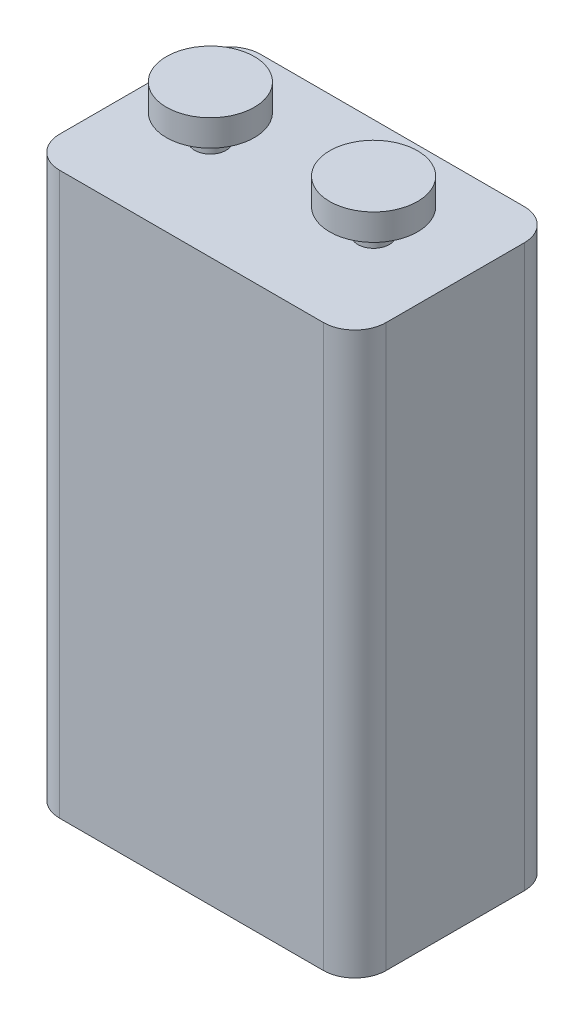
ISO-10303-21;
HEADER;
FILE_DESCRIPTION(('STEP AP214'),'2;1');
FILE_NAME('part.step','',(''),(''),'','','');
FILE_SCHEMA(('AUTOMOTIVE_DESIGN { 1 0 10303 214 1 1 1 1 }'));
ENDSEC;
DATA;
#1=APPLICATION_CONTEXT('core data for automotive mechanical design processes');
#2=APPLICATION_PROTOCOL_DEFINITION('international standard','automotive_design',2000,#1);
#3=PRODUCT_CONTEXT('',#1,'mechanical');
#4=PRODUCT('Part','Part','',(#3));
#5=PRODUCT_RELATED_PRODUCT_CATEGORY('part','',(#4));
#6=PRODUCT_DEFINITION_FORMATION('','',#4);
#7=PRODUCT_DEFINITION_CONTEXT('part definition',#1,'design');
#8=PRODUCT_DEFINITION('design','',#6,#7);
#9=PRODUCT_DEFINITION_SHAPE('','',#8);
#10=(LENGTH_UNIT() NAMED_UNIT(*) SI_UNIT(.MILLI.,.METRE.));
#11=(NAMED_UNIT(*) PLANE_ANGLE_UNIT() SI_UNIT($,.RADIAN.));
#12=(NAMED_UNIT(*) SI_UNIT($,.STERADIAN.) SOLID_ANGLE_UNIT());
#13=UNCERTAINTY_MEASURE_WITH_UNIT(LENGTH_MEASURE(1.E-05),#10,'distance_accuracy_value','');
#14=(GEOMETRIC_REPRESENTATION_CONTEXT(3) GLOBAL_UNCERTAINTY_ASSIGNED_CONTEXT((#13)) GLOBAL_UNIT_ASSIGNED_CONTEXT((#10,
#11,#12)) REPRESENTATION_CONTEXT('',''));
#15=CARTESIAN_POINT('',(0.,0.,0.));
#16=DIRECTION('',(0.,0.,1.));
#17=DIRECTION('',(1.,0.,0.));
#18=AXIS2_PLACEMENT_3D('',#15,#16,#17);
#19=CARTESIAN_POINT('',(6.5,48.8,0.));
#20=DIRECTION('',(0.,-1.,0.));
#21=DIRECTION('',(0.,0.,-1.));
#22=AXIS2_PLACEMENT_3D('',#19,#20,#21);
#23=CYLINDRICAL_SURFACE('',#22,1.25);
#24=CARTESIAN_POINT('',(6.5,44.7,0.));
#25=DIRECTION('',(0.,-1.,0.));
#26=DIRECTION('',(0.,0.,-1.));
#27=AXIS2_PLACEMENT_3D('',#24,#25,#26);
#28=CIRCLE('',#27,1.25);
#29=CARTESIAN_POINT('',(6.5,44.7,-1.25));
#30=VERTEX_POINT('',#29);
#31=EDGE_CURVE('E164',#30,#30,#28,.F.);
#32=ORIENTED_EDGE('',*,*,#31,.T.);
#33=EDGE_LOOP('',(#32));
#34=FACE_BOUND('',#33,.T.);
#35=CARTESIAN_POINT('',(6.5,46.7,0.));
#36=DIRECTION('',(0.,1.,0.));
#37=DIRECTION('',(0.,0.,1.));
#38=AXIS2_PLACEMENT_3D('',#35,#36,#37);
#39=CIRCLE('',#38,1.25);
#40=CARTESIAN_POINT('',(6.5,46.7,1.25));
#41=VERTEX_POINT('',#40);
#42=EDGE_CURVE('E11',#41,#41,#39,.T.);
#43=ORIENTED_EDGE('',*,*,#42,.F.);
#44=EDGE_LOOP('',(#43));
#45=FACE_BOUND('',#44,.T.);
#46=ADVANCED_FACE('F33',(#34,#45),#23,.T.);
#47=CARTESIAN_POINT('',(-6.5,48.8,0.));
#48=DIRECTION('',(0.,-1.,0.));
#49=DIRECTION('',(0.,0.,-1.));
#50=AXIS2_PLACEMENT_3D('',#47,#48,#49);
#51=CYLINDRICAL_SURFACE('',#50,1.25);
#52=CARTESIAN_POINT('',(-6.5,44.7,0.));
#53=DIRECTION('',(0.,-1.,0.));
#54=DIRECTION('',(0.,0.,-1.));
#55=AXIS2_PLACEMENT_3D('',#52,#53,#54);
#56=CIRCLE('',#55,1.25);
#57=CARTESIAN_POINT('',(-6.5,44.7,-1.25));
#58=VERTEX_POINT('',#57);
#59=EDGE_CURVE('E161',#58,#58,#56,.F.);
#60=ORIENTED_EDGE('',*,*,#59,.T.);
#61=EDGE_LOOP('',(#60));
#62=FACE_BOUND('',#61,.T.);
#63=CARTESIAN_POINT('',(-6.5,46.7,0.));
#64=DIRECTION('',(0.,1.,0.));
#65=DIRECTION('',(0.,0.,1.));
#66=AXIS2_PLACEMENT_3D('',#63,#64,#65);
#67=CIRCLE('',#66,1.25);
#68=CARTESIAN_POINT('',(-6.5,46.7,1.25));
#69=VERTEX_POINT('',#68);
#70=EDGE_CURVE('E42',#69,#69,#67,.T.);
#71=ORIENTED_EDGE('',*,*,#70,.F.);
#72=EDGE_LOOP('',(#71));
#73=FACE_BOUND('',#72,.T.);
#74=ADVANCED_FACE('F172',(#62,#73),#51,.T.);
#75=CARTESIAN_POINT('',(10.5,44.7,-5.5));
#76=DIRECTION('',(0.,-1.,0.));
#77=DIRECTION('',(0.,0.,-1.));
#78=AXIS2_PLACEMENT_3D('',#75,#76,#77);
#79=CYLINDRICAL_SURFACE('',#78,2.5);
#80=CARTESIAN_POINT('',(10.5,0.,-5.5));
#81=DIRECTION('',(0.,1.,0.));
#82=DIRECTION('',(0.,0.,-1.));
#83=AXIS2_PLACEMENT_3D('',#80,#81,#82);
#84=CIRCLE('',#83,2.5);
#85=CARTESIAN_POINT('',(13.,0.,-5.5));
#86=VERTEX_POINT('',#85);
#87=CARTESIAN_POINT('',(10.5,0.,-8.));
#88=VERTEX_POINT('',#87);
#89=EDGE_CURVE('E131',#86,#88,#84,.T.);
#90=ORIENTED_EDGE('',*,*,#89,.T.);
#91=DIRECTION('',(0.,-1.,0.));
#92=VECTOR('',#91,1.);
#93=CARTESIAN_POINT('',(10.5,44.7,-8.));
#94=LINE('',#93,#92);
#95=CARTESIAN_POINT('',(10.5,44.7,-8.));
#96=VERTEX_POINT('',#95);
#97=EDGE_CURVE('E159',#96,#88,#94,.T.);
#98=ORIENTED_EDGE('',*,*,#97,.F.);
#99=CARTESIAN_POINT('',(10.5,44.7,-5.5));
#100=DIRECTION('',(0.,1.,0.));
#101=DIRECTION('',(0.,0.,-1.));
#102=AXIS2_PLACEMENT_3D('',#99,#100,#101);
#103=CIRCLE('',#102,2.5);
#104=CARTESIAN_POINT('',(13.,44.7,-5.5));
#105=VERTEX_POINT('',#104);
#106=EDGE_CURVE('E146',#105,#96,#103,.T.);
#107=ORIENTED_EDGE('',*,*,#106,.F.);
#108=DIRECTION('',(0.,-1.,0.));
#109=VECTOR('',#108,1.);
#110=CARTESIAN_POINT('',(13.,44.7,-5.5));
#111=LINE('',#110,#109);
#112=EDGE_CURVE('E127',#105,#86,#111,.T.);
#113=ORIENTED_EDGE('',*,*,#112,.T.);
#114=EDGE_LOOP('',(#90,#98,#107,#113));
#115=FACE_BOUND('',#114,.T.);
#116=ADVANCED_FACE('F35',(#115),#79,.T.);
#117=CARTESIAN_POINT('',(-10.5,44.7,-8.));
#118=DIRECTION('',(0.,0.,1.));
#119=DIRECTION('',(1.,0.,0.));
#120=AXIS2_PLACEMENT_3D('',#117,#118,#119);
#121=PLANE('',#120);
#122=DIRECTION('',(-1.,0.,0.));
#123=VECTOR('',#122,1.);
#124=CARTESIAN_POINT('',(-10.5,0.,-8.));
#125=LINE('',#124,#123);
#126=CARTESIAN_POINT('',(-10.5,0.,-8.));
#127=VERTEX_POINT('',#126);
#128=EDGE_CURVE('E134',#88,#127,#125,.T.);
#129=ORIENTED_EDGE('',*,*,#128,.T.);
#130=DIRECTION('',(0.,-1.,0.));
#131=VECTOR('',#130,1.);
#132=CARTESIAN_POINT('',(-10.5,44.7,-8.));
#133=LINE('',#132,#131);
#134=CARTESIAN_POINT('',(-10.5,44.7,-8.));
#135=VERTEX_POINT('',#134);
#136=EDGE_CURVE('E156',#135,#127,#133,.T.);
#137=ORIENTED_EDGE('',*,*,#136,.F.);
#138=DIRECTION('',(-1.,0.,0.));
#139=VECTOR('',#138,1.);
#140=CARTESIAN_POINT('',(-10.5,44.7,-8.));
#141=LINE('',#140,#139);
#142=EDGE_CURVE('E94',#96,#135,#141,.T.);
#143=ORIENTED_EDGE('',*,*,#142,.F.);
#144=ORIENTED_EDGE('',*,*,#97,.T.);
#145=EDGE_LOOP('',(#129,#137,#143,#144));
#146=FACE_BOUND('',#145,.T.);
#147=ADVANCED_FACE('F180',(#146),#121,.F.);
#148=CARTESIAN_POINT('',(-10.5,44.7,-5.5));
#149=DIRECTION('',(0.,-1.,0.));
#150=DIRECTION('',(0.,0.,-1.));
#151=AXIS2_PLACEMENT_3D('',#148,#149,#150);
#152=CYLINDRICAL_SURFACE('',#151,2.5);
#153=CARTESIAN_POINT('',(-10.5,0.,-5.5));
#154=DIRECTION('',(0.,1.,0.));
#155=DIRECTION('',(0.,0.,-1.));
#156=AXIS2_PLACEMENT_3D('',#153,#154,#155);
#157=CIRCLE('',#156,2.5);
#158=CARTESIAN_POINT('',(-13.,0.,-5.5));
#159=VERTEX_POINT('',#158);
#160=EDGE_CURVE('E137',#127,#159,#157,.T.);
#161=ORIENTED_EDGE('',*,*,#160,.T.);
#162=DIRECTION('',(0.,-1.,0.));
#163=VECTOR('',#162,1.);
#164=CARTESIAN_POINT('',(-13.,44.7,-5.5));
#165=LINE('',#164,#163);
#166=CARTESIAN_POINT('',(-13.,44.7,-5.5));
#167=VERTEX_POINT('',#166);
#168=EDGE_CURVE('E153',#167,#159,#165,.T.);
#169=ORIENTED_EDGE('',*,*,#168,.F.);
#170=CARTESIAN_POINT('',(-10.5,44.7,-5.5));
#171=DIRECTION('',(0.,1.,0.));
#172=DIRECTION('',(0.,0.,-1.));
#173=AXIS2_PLACEMENT_3D('',#170,#171,#172);
#174=CIRCLE('',#173,2.5);
#175=EDGE_CURVE('E221',#135,#167,#174,.T.);
#176=ORIENTED_EDGE('',*,*,#175,.F.);
#177=ORIENTED_EDGE('',*,*,#136,.T.);
#178=EDGE_LOOP('',(#161,#169,#176,#177));
#179=FACE_BOUND('',#178,.T.);
#180=ADVANCED_FACE('F209',(#179),#152,.T.);
#181=CARTESIAN_POINT('',(-13.,44.7,-5.5));
#182=DIRECTION('',(1.,0.,0.));
#183=DIRECTION('',(0.,0.,-1.));
#184=AXIS2_PLACEMENT_3D('',#181,#182,#183);
#185=PLANE('',#184);
#186=DIRECTION('',(0.,0.,1.));
#187=VECTOR('',#186,1.);
#188=CARTESIAN_POINT('',(-13.,0.,-5.5));
#189=LINE('',#188,#187);
#190=CARTESIAN_POINT('',(-13.,0.,5.5));
#191=VERTEX_POINT('',#190);
#192=EDGE_CURVE('E139',#159,#191,#189,.T.);
#193=ORIENTED_EDGE('',*,*,#192,.T.);
#194=DIRECTION('',(0.,-1.,0.));
#195=VECTOR('',#194,1.);
#196=CARTESIAN_POINT('',(-13.,44.7,5.5));
#197=LINE('',#196,#195);
#198=CARTESIAN_POINT('',(-13.,44.7,5.5));
#199=VERTEX_POINT('',#198);
#200=EDGE_CURVE('E150',#199,#191,#197,.T.);
#201=ORIENTED_EDGE('',*,*,#200,.F.);
#202=DIRECTION('',(0.,0.,1.));
#203=VECTOR('',#202,1.);
#204=CARTESIAN_POINT('',(-13.,44.7,-5.5));
#205=LINE('',#204,#203);
#206=EDGE_CURVE('E226',#167,#199,#205,.T.);
#207=ORIENTED_EDGE('',*,*,#206,.F.);
#208=ORIENTED_EDGE('',*,*,#168,.T.);
#209=EDGE_LOOP('',(#193,#201,#207,#208));
#210=FACE_BOUND('',#209,.T.);
#211=ADVANCED_FACE('F205',(#210),#185,.F.);
#212=CARTESIAN_POINT('',(-10.5,44.7,5.5));
#213=DIRECTION('',(0.,-1.,0.));
#214=DIRECTION('',(0.,0.,-1.));
#215=AXIS2_PLACEMENT_3D('',#212,#213,#214);
#216=CYLINDRICAL_SURFACE('',#215,2.5);
#217=CARTESIAN_POINT('',(-10.5,0.,5.5));
#218=DIRECTION('',(0.,1.,0.));
#219=DIRECTION('',(0.,0.,-1.));
#220=AXIS2_PLACEMENT_3D('',#217,#218,#219);
#221=CIRCLE('',#220,2.5);
#222=CARTESIAN_POINT('',(-10.5,0.,8.));
#223=VERTEX_POINT('',#222);
#224=EDGE_CURVE('E141',#191,#223,#221,.T.);
#225=ORIENTED_EDGE('',*,*,#224,.T.);
#226=DIRECTION('',(0.,-1.,0.));
#227=VECTOR('',#226,1.);
#228=CARTESIAN_POINT('',(-10.5,44.7,8.));
#229=LINE('',#228,#227);
#230=CARTESIAN_POINT('',(-10.5,44.7,8.));
#231=VERTEX_POINT('',#230);
#232=EDGE_CURVE('E122',#231,#223,#229,.T.);
#233=ORIENTED_EDGE('',*,*,#232,.F.);
#234=CARTESIAN_POINT('',(-10.5,44.7,5.5));
#235=DIRECTION('',(0.,1.,0.));
#236=DIRECTION('',(0.,0.,-1.));
#237=AXIS2_PLACEMENT_3D('',#234,#235,#236);
#238=CIRCLE('',#237,2.5);
#239=EDGE_CURVE('E113',#199,#231,#238,.T.);
#240=ORIENTED_EDGE('',*,*,#239,.F.);
#241=ORIENTED_EDGE('',*,*,#200,.T.);
#242=EDGE_LOOP('',(#225,#233,#240,#241));
#243=FACE_BOUND('',#242,.T.);
#244=ADVANCED_FACE('F202',(#243),#216,.T.);
#245=CARTESIAN_POINT('',(-10.5,44.7,8.));
#246=DIRECTION('',(0.,0.,-1.));
#247=DIRECTION('',(-1.,0.,0.));
#248=AXIS2_PLACEMENT_3D('',#245,#246,#247);
#249=PLANE('',#248);
#250=DIRECTION('',(1.,0.,0.));
#251=VECTOR('',#250,1.);
#252=CARTESIAN_POINT('',(-10.5,0.,8.));
#253=LINE('',#252,#251);
#254=CARTESIAN_POINT('',(10.5,0.,8.));
#255=VERTEX_POINT('',#254);
#256=EDGE_CURVE('E121',#223,#255,#253,.T.);
#257=ORIENTED_EDGE('',*,*,#256,.T.);
#258=DIRECTION('',(0.,-1.,0.));
#259=VECTOR('',#258,1.);
#260=CARTESIAN_POINT('',(10.5,44.7,8.));
#261=LINE('',#260,#259);
#262=CARTESIAN_POINT('',(10.5,44.7,8.));
#263=VERTEX_POINT('',#262);
#264=EDGE_CURVE('E118',#263,#255,#261,.T.);
#265=ORIENTED_EDGE('',*,*,#264,.F.);
#266=DIRECTION('',(1.,0.,0.));
#267=VECTOR('',#266,1.);
#268=CARTESIAN_POINT('',(-10.5,44.7,8.));
#269=LINE('',#268,#267);
#270=EDGE_CURVE('E107',#231,#263,#269,.T.);
#271=ORIENTED_EDGE('',*,*,#270,.F.);
#272=ORIENTED_EDGE('',*,*,#232,.T.);
#273=EDGE_LOOP('',(#257,#265,#271,#272));
#274=FACE_BOUND('',#273,.T.);
#275=ADVANCED_FACE('F119',(#274),#249,.F.);
#276=CARTESIAN_POINT('',(10.5,44.7,5.5));
#277=DIRECTION('',(0.,-1.,0.));
#278=DIRECTION('',(0.,0.,-1.));
#279=AXIS2_PLACEMENT_3D('',#276,#277,#278);
#280=CYLINDRICAL_SURFACE('',#279,2.5);
#281=CARTESIAN_POINT('',(10.5,0.,5.5));
#282=DIRECTION('',(0.,1.,0.));
#283=DIRECTION('',(0.,0.,-1.));
#284=AXIS2_PLACEMENT_3D('',#281,#282,#283);
#285=CIRCLE('',#284,2.5);
#286=CARTESIAN_POINT('',(13.,0.,5.5));
#287=VERTEX_POINT('',#286);
#288=EDGE_CURVE('E79',#255,#287,#285,.T.);
#289=ORIENTED_EDGE('',*,*,#288,.T.);
#290=DIRECTION('',(0.,-1.,0.));
#291=VECTOR('',#290,1.);
#292=CARTESIAN_POINT('',(13.,44.7,5.5));
#293=LINE('',#292,#291);
#294=CARTESIAN_POINT('',(13.,44.7,5.5));
#295=VERTEX_POINT('',#294);
#296=EDGE_CURVE('E123',#295,#287,#293,.T.);
#297=ORIENTED_EDGE('',*,*,#296,.F.);
#298=CARTESIAN_POINT('',(10.5,44.7,5.5));
#299=DIRECTION('',(0.,1.,0.));
#300=DIRECTION('',(0.,0.,-1.));
#301=AXIS2_PLACEMENT_3D('',#298,#299,#300);
#302=CIRCLE('',#301,2.5);
#303=EDGE_CURVE('E111',#263,#295,#302,.T.);
#304=ORIENTED_EDGE('',*,*,#303,.F.);
#305=ORIENTED_EDGE('',*,*,#264,.T.);
#306=EDGE_LOOP('',(#289,#297,#304,#305));
#307=FACE_BOUND('',#306,.T.);
#308=ADVANCED_FACE('F125',(#307),#280,.T.);
#309=CARTESIAN_POINT('',(13.,44.7,-5.5));
#310=DIRECTION('',(-1.,0.,0.));
#311=DIRECTION('',(0.,0.,1.));
#312=AXIS2_PLACEMENT_3D('',#309,#310,#311);
#313=PLANE('',#312);
#314=DIRECTION('',(0.,0.,-1.));
#315=VECTOR('',#314,1.);
#316=CARTESIAN_POINT('',(13.,0.,-5.5));
#317=LINE('',#316,#315);
#318=EDGE_CURVE('E85',#287,#86,#317,.T.);
#319=ORIENTED_EDGE('',*,*,#318,.T.);
#320=ORIENTED_EDGE('',*,*,#112,.F.);
#321=DIRECTION('',(0.,0.,-1.));
#322=VECTOR('',#321,1.);
#323=CARTESIAN_POINT('',(13.,44.7,-5.5));
#324=LINE('',#323,#322);
#325=EDGE_CURVE('E50',#295,#105,#324,.T.);
#326=ORIENTED_EDGE('',*,*,#325,.F.);
#327=ORIENTED_EDGE('',*,*,#296,.T.);
#328=EDGE_LOOP('',(#319,#320,#326,#327));
#329=FACE_BOUND('',#328,.T.);
#330=ADVANCED_FACE('F190',(#329),#313,.F.);
#331=CARTESIAN_POINT('',(10.5,44.7,-5.5));
#332=DIRECTION('',(0.,-1.,0.));
#333=DIRECTION('',(0.,0.,-1.));
#334=AXIS2_PLACEMENT_3D('',#331,#332,#333);
#335=PLANE('',#334);
#336=ORIENTED_EDGE('',*,*,#31,.F.);
#337=EDGE_LOOP('',(#336));
#338=FACE_BOUND('',#337,.T.);
#339=ORIENTED_EDGE('',*,*,#59,.F.);
#340=EDGE_LOOP('',(#339));
#341=FACE_BOUND('',#340,.T.);
#342=ORIENTED_EDGE('',*,*,#106,.T.);
#343=ORIENTED_EDGE('',*,*,#142,.T.);
#344=ORIENTED_EDGE('',*,*,#175,.T.);
#345=ORIENTED_EDGE('',*,*,#206,.T.);
#346=ORIENTED_EDGE('',*,*,#239,.T.);
#347=ORIENTED_EDGE('',*,*,#270,.T.);
#348=ORIENTED_EDGE('',*,*,#303,.T.);
#349=ORIENTED_EDGE('',*,*,#325,.T.);
#350=EDGE_LOOP('',(#342,#343,#344,#345,#346,#347,#348,#349));
#351=FACE_BOUND('',#350,.T.);
#352=ADVANCED_FACE('F109',(#338,#341,#351),#335,.F.);
#353=CARTESIAN_POINT('',(10.5,0.,-5.5));
#354=DIRECTION('',(0.,-1.,0.));
#355=DIRECTION('',(0.,0.,-1.));
#356=AXIS2_PLACEMENT_3D('',#353,#354,#355);
#357=PLANE('',#356);
#358=ORIENTED_EDGE('',*,*,#89,.F.);
#359=ORIENTED_EDGE('',*,*,#318,.F.);
#360=ORIENTED_EDGE('',*,*,#288,.F.);
#361=ORIENTED_EDGE('',*,*,#256,.F.);
#362=ORIENTED_EDGE('',*,*,#224,.F.);
#363=ORIENTED_EDGE('',*,*,#192,.F.);
#364=ORIENTED_EDGE('',*,*,#160,.F.);
#365=ORIENTED_EDGE('',*,*,#128,.F.);
#366=EDGE_LOOP('',(#358,#359,#360,#361,#362,#363,#364,#365));
#367=FACE_BOUND('',#366,.T.);
#368=ADVANCED_FACE('F189',(#367),#357,.T.);
#369=CARTESIAN_POINT('',(-6.5,46.7,0.));
#370=DIRECTION('',(0.,1.,0.));
#371=DIRECTION('',(0.,0.,1.));
#372=AXIS2_PLACEMENT_3D('',#369,#370,#371);
#373=CYLINDRICAL_SURFACE('',#372,3.5);
#374=CARTESIAN_POINT('',(-6.5,46.7,0.));
#375=DIRECTION('',(0.,1.,0.));
#376=DIRECTION('',(0.,0.,1.));
#377=AXIS2_PLACEMENT_3D('',#374,#375,#376);
#378=CIRCLE('',#377,3.5);
#379=CARTESIAN_POINT('',(-6.5,46.7,3.5));
#380=VERTEX_POINT('',#379);
#381=EDGE_CURVE('E135',#380,#380,#378,.T.);
#382=ORIENTED_EDGE('',*,*,#381,.T.);
#383=EDGE_LOOP('',(#382));
#384=FACE_BOUND('',#383,.T.);
#385=CARTESIAN_POINT('',(-6.5,48.8,0.));
#386=DIRECTION('',(0.,1.,0.));
#387=DIRECTION('',(0.,0.,1.));
#388=AXIS2_PLACEMENT_3D('',#385,#386,#387);
#389=CIRCLE('',#388,3.5);
#390=CARTESIAN_POINT('',(-6.5,48.8,3.5));
#391=VERTEX_POINT('',#390);
#392=EDGE_CURVE('E232',#391,#391,#389,.T.);
#393=ORIENTED_EDGE('',*,*,#392,.F.);
#394=EDGE_LOOP('',(#393));
#395=FACE_BOUND('',#394,.T.);
#396=ADVANCED_FACE('F194',(#384,#395),#373,.T.);
#397=CARTESIAN_POINT('',(-6.5,46.7,0.));
#398=DIRECTION('',(0.,1.,0.));
#399=DIRECTION('',(0.,0.,1.));
#400=AXIS2_PLACEMENT_3D('',#397,#398,#399);
#401=PLANE('',#400);
#402=ORIENTED_EDGE('',*,*,#70,.T.);
#403=EDGE_LOOP('',(#402));
#404=FACE_BOUND('',#403,.T.);
#405=ORIENTED_EDGE('',*,*,#381,.F.);
#406=EDGE_LOOP('',(#405));
#407=FACE_BOUND('',#406,.T.);
#408=ADVANCED_FACE('F169',(#404,#407),#401,.F.);
#409=CARTESIAN_POINT('',(-6.5,48.8,0.));
#410=DIRECTION('',(0.,1.,0.));
#411=DIRECTION('',(0.,0.,1.));
#412=AXIS2_PLACEMENT_3D('',#409,#410,#411);
#413=PLANE('',#412);
#414=ORIENTED_EDGE('',*,*,#392,.T.);
#415=EDGE_LOOP('',(#414));
#416=FACE_BOUND('',#415,.T.);
#417=ADVANCED_FACE('F186',(#416),#413,.T.);
#418=CARTESIAN_POINT('',(6.5,46.7,0.));
#419=DIRECTION('',(0.,1.,0.));
#420=DIRECTION('',(0.,0.,1.));
#421=AXIS2_PLACEMENT_3D('',#418,#419,#420);
#422=CYLINDRICAL_SURFACE('',#421,3.5);
#423=CARTESIAN_POINT('',(6.5,46.7,0.));
#424=DIRECTION('',(0.,1.,0.));
#425=DIRECTION('',(0.,0.,1.));
#426=AXIS2_PLACEMENT_3D('',#423,#424,#425);
#427=CIRCLE('',#426,3.5);
#428=CARTESIAN_POINT('',(6.5,46.7,3.5));
#429=VERTEX_POINT('',#428);
#430=EDGE_CURVE('E235',#429,#429,#427,.T.);
#431=ORIENTED_EDGE('',*,*,#430,.T.);
#432=EDGE_LOOP('',(#431));
#433=FACE_BOUND('',#432,.T.);
#434=CARTESIAN_POINT('',(6.5,48.8,0.));
#435=DIRECTION('',(0.,1.,0.));
#436=DIRECTION('',(0.,0.,1.));
#437=AXIS2_PLACEMENT_3D('',#434,#435,#436);
#438=CIRCLE('',#437,3.5);
#439=CARTESIAN_POINT('',(6.5,48.8,3.5));
#440=VERTEX_POINT('',#439);
#441=EDGE_CURVE('E238',#440,#440,#438,.T.);
#442=ORIENTED_EDGE('',*,*,#441,.F.);
#443=EDGE_LOOP('',(#442));
#444=FACE_BOUND('',#443,.T.);
#445=ADVANCED_FACE('F244',(#433,#444),#422,.T.);
#446=CARTESIAN_POINT('',(6.5,46.7,0.));
#447=DIRECTION('',(0.,1.,0.));
#448=DIRECTION('',(0.,0.,1.));
#449=AXIS2_PLACEMENT_3D('',#446,#447,#448);
#450=PLANE('',#449);
#451=ORIENTED_EDGE('',*,*,#42,.T.);
#452=EDGE_LOOP('',(#451));
#453=FACE_BOUND('',#452,.T.);
#454=ORIENTED_EDGE('',*,*,#430,.F.);
#455=EDGE_LOOP('',(#454));
#456=FACE_BOUND('',#455,.T.);
#457=ADVANCED_FACE('F247',(#453,#456),#450,.F.);
#458=CARTESIAN_POINT('',(6.5,48.8,0.));
#459=DIRECTION('',(0.,1.,0.));
#460=DIRECTION('',(0.,0.,1.));
#461=AXIS2_PLACEMENT_3D('',#458,#459,#460);
#462=PLANE('',#461);
#463=ORIENTED_EDGE('',*,*,#441,.T.);
#464=EDGE_LOOP('',(#463));
#465=FACE_BOUND('',#464,.T.);
#466=ADVANCED_FACE('F249',(#465),#462,.T.);
#467=CLOSED_SHELL('',(#46,#74,#116,#147,#180,#211,#244,#275,#308,#330,#352,#368,#396,#408,#417,
#445,#457,#466));
#468=MANIFOLD_SOLID_BREP('B2',#467);
#469=ADVANCED_BREP_SHAPE_REPRESENTATION('',(#18,#468),#14);
#470=SHAPE_DEFINITION_REPRESENTATION(#9,#469);
ENDSEC;
END-ISO-10303-21;
